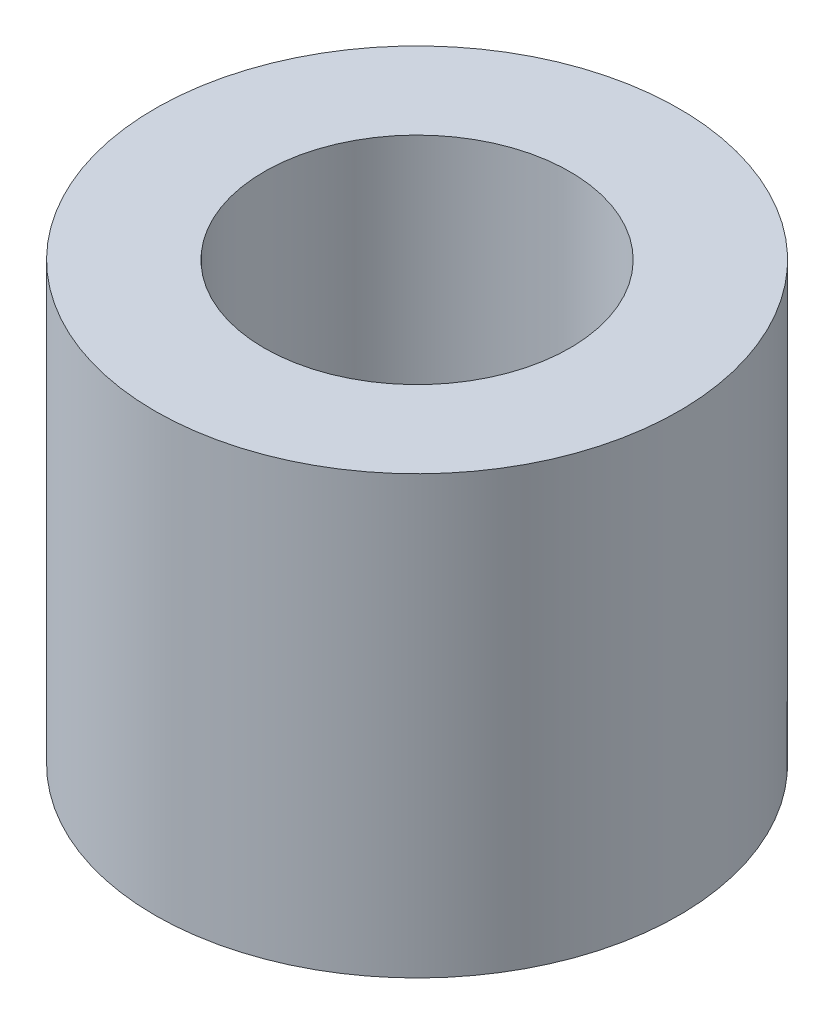
ISO-10303-21;
HEADER;
FILE_DESCRIPTION(('STEP AP214'),'2;1');
FILE_NAME('part.step','',(''),(''),'','','');
FILE_SCHEMA(('AUTOMOTIVE_DESIGN { 1 0 10303 214 1 1 1 1 }'));
ENDSEC;
DATA;
#1=APPLICATION_CONTEXT('core data for automotive mechanical design processes');
#2=APPLICATION_PROTOCOL_DEFINITION('international standard','automotive_design',2000,#1);
#3=PRODUCT_CONTEXT('',#1,'mechanical');
#4=PRODUCT('Part','Part','',(#3));
#5=PRODUCT_RELATED_PRODUCT_CATEGORY('part','',(#4));
#6=PRODUCT_DEFINITION_FORMATION('','',#4);
#7=PRODUCT_DEFINITION_CONTEXT('part definition',#1,'design');
#8=PRODUCT_DEFINITION('design','',#6,#7);
#9=PRODUCT_DEFINITION_SHAPE('','',#8);
#10=(LENGTH_UNIT() NAMED_UNIT(*) SI_UNIT(.MILLI.,.METRE.));
#11=(NAMED_UNIT(*) PLANE_ANGLE_UNIT() SI_UNIT($,.RADIAN.));
#12=(NAMED_UNIT(*) SI_UNIT($,.STERADIAN.) SOLID_ANGLE_UNIT());
#13=UNCERTAINTY_MEASURE_WITH_UNIT(LENGTH_MEASURE(1.E-05),#10,'distance_accuracy_value','');
#14=(GEOMETRIC_REPRESENTATION_CONTEXT(3) GLOBAL_UNCERTAINTY_ASSIGNED_CONTEXT((#13)) GLOBAL_UNIT_ASSIGNED_CONTEXT((#10,
#11,#12)) REPRESENTATION_CONTEXT('',''));
#15=CARTESIAN_POINT('',(0.,0.,0.));
#16=DIRECTION('',(0.,0.,1.));
#17=DIRECTION('',(1.,0.,0.));
#18=AXIS2_PLACEMENT_3D('',#15,#16,#17);
#19=CARTESIAN_POINT('',(0.,5.,0.));
#20=DIRECTION('',(0.,1.,0.));
#21=DIRECTION('',(0.,0.,1.));
#22=AXIS2_PLACEMENT_3D('',#19,#20,#21);
#23=PLANE('',#22);
#24=CARTESIAN_POINT('',(0.,5.,0.));
#25=DIRECTION('',(0.,1.,0.));
#26=DIRECTION('',(0.,0.,1.));
#27=AXIS2_PLACEMENT_3D('',#24,#25,#26);
#28=CIRCLE('',#27,3.);
#29=CARTESIAN_POINT('',(0.,5.,3.));
#30=VERTEX_POINT('',#29);
#31=EDGE_CURVE('E10',#30,#30,#28,.T.);
#32=ORIENTED_EDGE('',*,*,#31,.T.);
#33=EDGE_LOOP('',(#32));
#34=FACE_BOUND('',#33,.T.);
#35=CARTESIAN_POINT('',(0.,5.,0.));
#36=DIRECTION('',(0.,1.,0.));
#37=DIRECTION('',(0.,0.,1.));
#38=AXIS2_PLACEMENT_3D('',#35,#36,#37);
#39=CIRCLE('',#38,1.75);
#40=CARTESIAN_POINT('',(0.,5.,1.75));
#41=VERTEX_POINT('',#40);
#42=EDGE_CURVE('E42',#41,#41,#39,.T.);
#43=ORIENTED_EDGE('',*,*,#42,.F.);
#44=EDGE_LOOP('',(#43));
#45=FACE_BOUND('',#44,.T.);
#46=ADVANCED_FACE('F31',(#34,#45),#23,.T.);
#47=CARTESIAN_POINT('',(0.,0.,0.));
#48=DIRECTION('',(0.,1.,0.));
#49=DIRECTION('',(0.,0.,1.));
#50=AXIS2_PLACEMENT_3D('',#47,#48,#49);
#51=PLANE('',#50);
#52=CARTESIAN_POINT('',(0.,0.,0.));
#53=DIRECTION('',(0.,1.,0.));
#54=DIRECTION('',(0.,0.,1.));
#55=AXIS2_PLACEMENT_3D('',#52,#53,#54);
#56=CIRCLE('',#55,3.);
#57=CARTESIAN_POINT('',(0.,0.,3.));
#58=VERTEX_POINT('',#57);
#59=EDGE_CURVE('E35',#58,#58,#56,.T.);
#60=ORIENTED_EDGE('',*,*,#59,.F.);
#61=EDGE_LOOP('',(#60));
#62=FACE_BOUND('',#61,.T.);
#63=CARTESIAN_POINT('',(0.,0.,0.));
#64=DIRECTION('',(0.,1.,0.));
#65=DIRECTION('',(0.,0.,1.));
#66=AXIS2_PLACEMENT_3D('',#63,#64,#65);
#67=CIRCLE('',#66,1.75);
#68=CARTESIAN_POINT('',(0.,0.,1.75));
#69=VERTEX_POINT('',#68);
#70=EDGE_CURVE('E44',#69,#69,#67,.T.);
#71=ORIENTED_EDGE('',*,*,#70,.T.);
#72=EDGE_LOOP('',(#71));
#73=FACE_BOUND('',#72,.T.);
#74=ADVANCED_FACE('F54',(#62,#73),#51,.F.);
#75=CARTESIAN_POINT('',(0.,5.,0.));
#76=DIRECTION('',(0.,-1.,0.));
#77=DIRECTION('',(0.,0.,-1.));
#78=AXIS2_PLACEMENT_3D('',#75,#76,#77);
#79=CYLINDRICAL_SURFACE('',#78,3.);
#80=ORIENTED_EDGE('',*,*,#31,.F.);
#81=EDGE_LOOP('',(#80));
#82=FACE_BOUND('',#81,.T.);
#83=ORIENTED_EDGE('',*,*,#59,.T.);
#84=EDGE_LOOP('',(#83));
#85=FACE_BOUND('',#84,.T.);
#86=ADVANCED_FACE('F33',(#82,#85),#79,.T.);
#87=CARTESIAN_POINT('',(0.,5.,0.));
#88=DIRECTION('',(0.,-1.,0.));
#89=DIRECTION('',(0.,0.,-1.));
#90=AXIS2_PLACEMENT_3D('',#87,#88,#89);
#91=CYLINDRICAL_SURFACE('',#90,1.75);
#92=ORIENTED_EDGE('',*,*,#42,.T.);
#93=EDGE_LOOP('',(#92));
#94=FACE_BOUND('',#93,.T.);
#95=ORIENTED_EDGE('',*,*,#70,.F.);
#96=EDGE_LOOP('',(#95));
#97=FACE_BOUND('',#96,.T.);
#98=ADVANCED_FACE('F50',(#94,#97),#91,.F.);
#99=CLOSED_SHELL('',(#46,#74,#86,#98));
#100=MANIFOLD_SOLID_BREP('B2',#99);
#101=ADVANCED_BREP_SHAPE_REPRESENTATION('',(#18,#100),#14);
#102=SHAPE_DEFINITION_REPRESENTATION(#9,#101);
ENDSEC;
END-ISO-10303-21;
